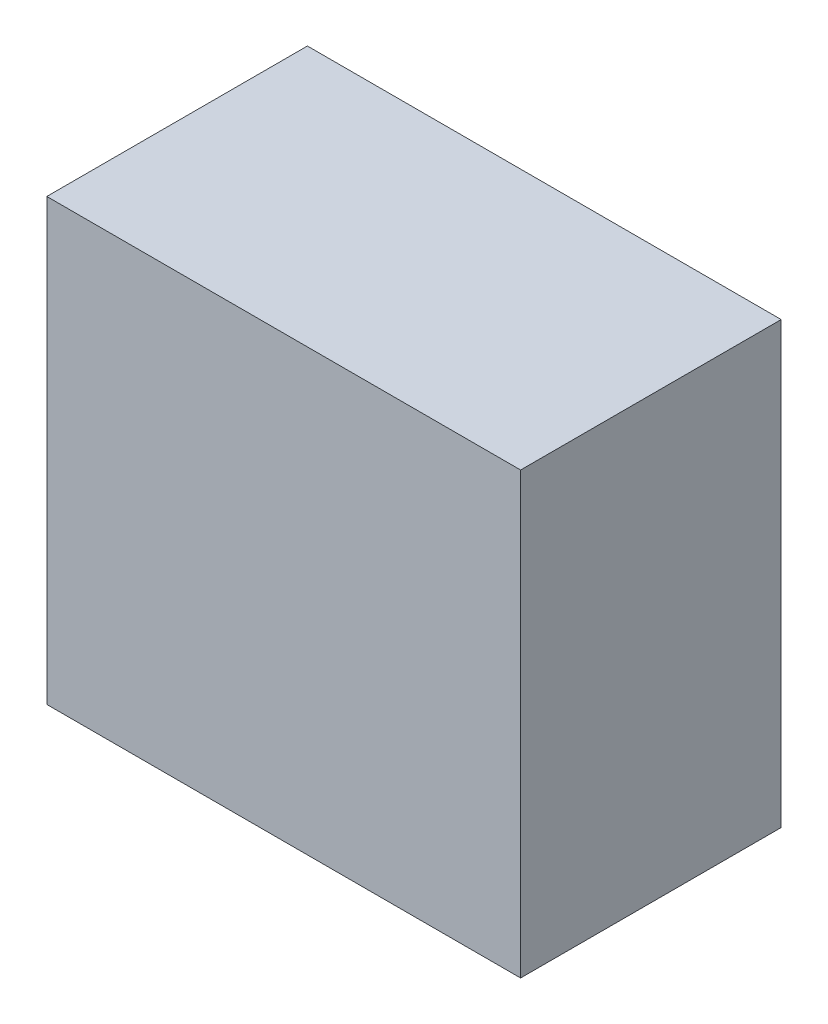
ISO-10303-21;
HEADER;
FILE_DESCRIPTION(('STEP AP214'),'2;1');
FILE_NAME('part.step','',(''),(''),'','','');
FILE_SCHEMA(('AUTOMOTIVE_DESIGN { 1 0 10303 214 1 1 1 1 }'));
ENDSEC;
DATA;
#1=APPLICATION_CONTEXT('core data for automotive mechanical design processes');
#2=APPLICATION_PROTOCOL_DEFINITION('international standard','automotive_design',2000,#1);
#3=PRODUCT_CONTEXT('',#1,'mechanical');
#4=PRODUCT('Part','Part','',(#3));
#5=PRODUCT_RELATED_PRODUCT_CATEGORY('part','',(#4));
#6=PRODUCT_DEFINITION_FORMATION('','',#4);
#7=PRODUCT_DEFINITION_CONTEXT('part definition',#1,'design');
#8=PRODUCT_DEFINITION('design','',#6,#7);
#9=PRODUCT_DEFINITION_SHAPE('','',#8);
#10=(LENGTH_UNIT() NAMED_UNIT(*) SI_UNIT(.MILLI.,.METRE.));
#11=(NAMED_UNIT(*) PLANE_ANGLE_UNIT() SI_UNIT($,.RADIAN.));
#12=(NAMED_UNIT(*) SI_UNIT($,.STERADIAN.) SOLID_ANGLE_UNIT());
#13=UNCERTAINTY_MEASURE_WITH_UNIT(LENGTH_MEASURE(1.E-05),#10,'distance_accuracy_value','');
#14=(GEOMETRIC_REPRESENTATION_CONTEXT(3) GLOBAL_UNCERTAINTY_ASSIGNED_CONTEXT((#13)) GLOBAL_UNIT_ASSIGNED_CONTEXT((#10,
#11,#12)) REPRESENTATION_CONTEXT('',''));
#15=CARTESIAN_POINT('',(0.,0.,0.));
#16=DIRECTION('',(0.,0.,1.));
#17=DIRECTION('',(1.,0.,0.));
#18=AXIS2_PLACEMENT_3D('',#15,#16,#17);
#19=CARTESIAN_POINT('',(-6.9999987,-6.4999997,7.7));
#20=DIRECTION('',(0.,0.,1.));
#21=DIRECTION('',(1.,0.,0.));
#22=AXIS2_PLACEMENT_3D('',#19,#20,#21);
#23=PLANE('',#22);
#24=DIRECTION('',(1.,0.,0.));
#25=VECTOR('',#24,1.);
#26=CARTESIAN_POINT('',(-6.9999987,6.4999997,7.7));
#27=LINE('',#26,#25);
#28=CARTESIAN_POINT('',(-6.9999987,6.4999997,7.7));
#29=VERTEX_POINT('',#28);
#30=CARTESIAN_POINT('',(7.00000124,6.4999997,7.7));
#31=VERTEX_POINT('',#30);
#32=EDGE_CURVE('E53',#29,#31,#27,.T.);
#33=ORIENTED_EDGE('',*,*,#32,.F.);
#34=DIRECTION('',(0.,1.,0.));
#35=VECTOR('',#34,1.);
#36=CARTESIAN_POINT('',(-6.9999987,-6.4999997,7.7));
#37=LINE('',#36,#35);
#38=CARTESIAN_POINT('',(-6.9999987,-6.4999997,7.7));
#39=VERTEX_POINT('',#38);
#40=EDGE_CURVE('E68',#39,#29,#37,.T.);
#41=ORIENTED_EDGE('',*,*,#40,.F.);
#42=DIRECTION('',(1.,0.,0.));
#43=VECTOR('',#42,1.);
#44=CARTESIAN_POINT('',(7.00000124,-6.4999997,7.7));
#45=LINE('',#44,#43);
#46=CARTESIAN_POINT('',(7.00000124,-6.4999997,7.7));
#47=VERTEX_POINT('',#46);
#48=EDGE_CURVE('E20',#47,#39,#45,.F.);
#49=ORIENTED_EDGE('',*,*,#48,.F.);
#50=DIRECTION('',(0.,1.,0.));
#51=VECTOR('',#50,1.);
#52=CARTESIAN_POINT('',(7.00000124,6.4999997,7.7));
#53=LINE('',#52,#51);
#54=EDGE_CURVE('E58',#31,#47,#53,.F.);
#55=ORIENTED_EDGE('',*,*,#54,.F.);
#56=EDGE_LOOP('',(#33,#41,#49,#55));
#57=FACE_BOUND('',#56,.T.);
#58=ADVANCED_FACE('F17',(#57),#23,.T.);
#59=CARTESIAN_POINT('',(7.00000124,-6.4999997,0.));
#60=DIRECTION('',(0.,-1.,0.));
#61=DIRECTION('',(0.,0.,-1.));
#62=AXIS2_PLACEMENT_3D('',#59,#60,#61);
#63=PLANE('',#62);
#64=DIRECTION('',(0.,0.,1.));
#65=VECTOR('',#64,1.);
#66=CARTESIAN_POINT('',(-6.9999987,-6.4999997,0.));
#67=LINE('',#66,#65);
#68=CARTESIAN_POINT('',(-6.9999987,-6.4999997,0.));
#69=VERTEX_POINT('',#68);
#70=EDGE_CURVE('E79',#69,#39,#67,.T.);
#71=ORIENTED_EDGE('',*,*,#70,.F.);
#72=DIRECTION('',(1.,0.,0.));
#73=VECTOR('',#72,1.);
#74=CARTESIAN_POINT('',(-6.9999987,-6.4999997,0.));
#75=LINE('',#74,#73);
#76=CARTESIAN_POINT('',(7.00000124,-6.4999997,0.));
#77=VERTEX_POINT('',#76);
#78=EDGE_CURVE('E74',#69,#77,#75,.T.);
#79=ORIENTED_EDGE('',*,*,#78,.T.);
#80=DIRECTION('',(0.,0.,-1.));
#81=VECTOR('',#80,1.);
#82=CARTESIAN_POINT('',(7.00000124,-6.4999997,0.));
#83=LINE('',#82,#81);
#84=EDGE_CURVE('E63',#47,#77,#83,.T.);
#85=ORIENTED_EDGE('',*,*,#84,.F.);
#86=ORIENTED_EDGE('',*,*,#48,.T.);
#87=EDGE_LOOP('',(#71,#79,#85,#86));
#88=FACE_BOUND('',#87,.T.);
#89=ADVANCED_FACE('F73',(#88),#63,.T.);
#90=CARTESIAN_POINT('',(7.00000124,6.4999997,0.));
#91=DIRECTION('',(1.,0.,0.));
#92=DIRECTION('',(0.,0.,-1.));
#93=AXIS2_PLACEMENT_3D('',#90,#91,#92);
#94=PLANE('',#93);
#95=ORIENTED_EDGE('',*,*,#84,.T.);
#96=DIRECTION('',(0.,1.,0.));
#97=VECTOR('',#96,1.);
#98=CARTESIAN_POINT('',(7.00000124,-6.4999997,0.));
#99=LINE('',#98,#97);
#100=CARTESIAN_POINT('',(7.00000124,6.4999997,0.));
#101=VERTEX_POINT('',#100);
#102=EDGE_CURVE('E84',#77,#101,#99,.T.);
#103=ORIENTED_EDGE('',*,*,#102,.T.);
#104=DIRECTION('',(0.,0.,1.));
#105=VECTOR('',#104,1.);
#106=CARTESIAN_POINT('',(7.00000124,6.4999997,0.));
#107=LINE('',#106,#105);
#108=EDGE_CURVE('E65',#31,#101,#107,.F.);
#109=ORIENTED_EDGE('',*,*,#108,.F.);
#110=ORIENTED_EDGE('',*,*,#54,.T.);
#111=EDGE_LOOP('',(#95,#103,#109,#110));
#112=FACE_BOUND('',#111,.T.);
#113=ADVANCED_FACE('F60',(#112),#94,.T.);
#114=CARTESIAN_POINT('',(-6.9999987,6.4999997,0.));
#115=DIRECTION('',(0.,1.,0.));
#116=DIRECTION('',(0.,0.,1.));
#117=AXIS2_PLACEMENT_3D('',#114,#115,#116);
#118=PLANE('',#117);
#119=ORIENTED_EDGE('',*,*,#108,.T.);
#120=DIRECTION('',(1.,0.,0.));
#121=VECTOR('',#120,1.);
#122=CARTESIAN_POINT('',(-6.9999987,6.4999997,0.));
#123=LINE('',#122,#121);
#124=CARTESIAN_POINT('',(-6.9999987,6.4999997,0.));
#125=VERTEX_POINT('',#124);
#126=EDGE_CURVE('E26',#101,#125,#123,.F.);
#127=ORIENTED_EDGE('',*,*,#126,.T.);
#128=DIRECTION('',(0.,0.,1.));
#129=VECTOR('',#128,1.);
#130=CARTESIAN_POINT('',(-6.9999987,6.4999997,0.));
#131=LINE('',#130,#129);
#132=EDGE_CURVE('E34',#29,#125,#131,.F.);
#133=ORIENTED_EDGE('',*,*,#132,.F.);
#134=ORIENTED_EDGE('',*,*,#32,.T.);
#135=EDGE_LOOP('',(#119,#127,#133,#134));
#136=FACE_BOUND('',#135,.T.);
#137=ADVANCED_FACE('F88',(#136),#118,.T.);
#138=CARTESIAN_POINT('',(-6.9999987,-6.4999997,0.));
#139=DIRECTION('',(-1.,0.,0.));
#140=DIRECTION('',(0.,0.,1.));
#141=AXIS2_PLACEMENT_3D('',#138,#139,#140);
#142=PLANE('',#141);
#143=ORIENTED_EDGE('',*,*,#132,.T.);
#144=DIRECTION('',(0.,1.,0.));
#145=VECTOR('',#144,1.);
#146=CARTESIAN_POINT('',(-6.9999987,-6.4999997,0.));
#147=LINE('',#146,#145);
#148=EDGE_CURVE('E11',#125,#69,#147,.F.);
#149=ORIENTED_EDGE('',*,*,#148,.T.);
#150=ORIENTED_EDGE('',*,*,#70,.T.);
#151=ORIENTED_EDGE('',*,*,#40,.T.);
#152=EDGE_LOOP('',(#143,#149,#150,#151));
#153=FACE_BOUND('',#152,.T.);
#154=ADVANCED_FACE('F91',(#153),#142,.T.);
#155=CARTESIAN_POINT('',(-6.9999987,-6.4999997,0.));
#156=DIRECTION('',(0.,0.,1.));
#157=DIRECTION('',(1.,0.,0.));
#158=AXIS2_PLACEMENT_3D('',#155,#156,#157);
#159=PLANE('',#158);
#160=ORIENTED_EDGE('',*,*,#126,.F.);
#161=ORIENTED_EDGE('',*,*,#102,.F.);
#162=ORIENTED_EDGE('',*,*,#78,.F.);
#163=ORIENTED_EDGE('',*,*,#148,.F.);
#164=EDGE_LOOP('',(#160,#161,#162,#163));
#165=FACE_BOUND('',#164,.T.);
#166=ADVANCED_FACE('F90',(#165),#159,.F.);
#167=CLOSED_SHELL('',(#58,#89,#113,#137,#154,#166));
#168=MANIFOLD_SOLID_BREP('B1',#167);
#169=ADVANCED_BREP_SHAPE_REPRESENTATION('',(#18,#168),#14);
#170=SHAPE_DEFINITION_REPRESENTATION(#9,#169);
ENDSEC;
END-ISO-10303-21;
